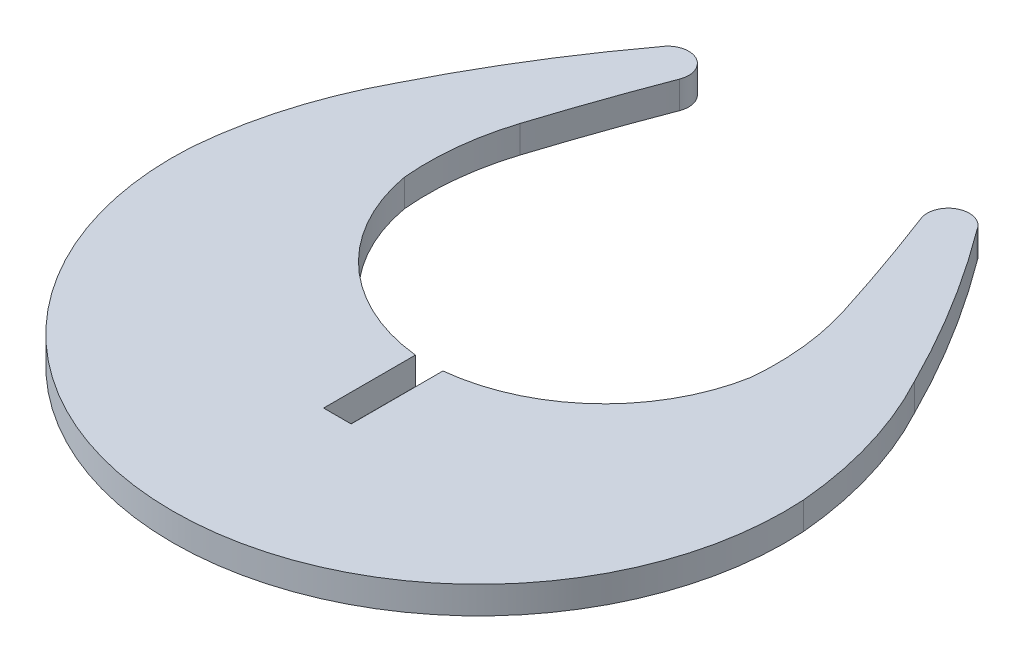
ISO-10303-21;
HEADER;
FILE_DESCRIPTION(('STEP AP214'),'2;1');
FILE_NAME('part.step','',(''),(''),'','','');
FILE_SCHEMA(('AUTOMOTIVE_DESIGN { 1 0 10303 214 1 1 1 1 }'));
ENDSEC;
DATA;
#1=APPLICATION_CONTEXT('core data for automotive mechanical design processes');
#2=APPLICATION_PROTOCOL_DEFINITION('international standard','automotive_design',2000,#1);
#3=PRODUCT_CONTEXT('',#1,'mechanical');
#4=PRODUCT('Part','Part','',(#3));
#5=PRODUCT_RELATED_PRODUCT_CATEGORY('part','',(#4));
#6=PRODUCT_DEFINITION_FORMATION('','',#4);
#7=PRODUCT_DEFINITION_CONTEXT('part definition',#1,'design');
#8=PRODUCT_DEFINITION('design','',#6,#7);
#9=PRODUCT_DEFINITION_SHAPE('','',#8);
#10=(LENGTH_UNIT() NAMED_UNIT(*) SI_UNIT(.MILLI.,.METRE.));
#11=(NAMED_UNIT(*) PLANE_ANGLE_UNIT() SI_UNIT($,.RADIAN.));
#12=(NAMED_UNIT(*) SI_UNIT($,.STERADIAN.) SOLID_ANGLE_UNIT());
#13=UNCERTAINTY_MEASURE_WITH_UNIT(LENGTH_MEASURE(1.E-05),#10,'distance_accuracy_value','');
#14=(GEOMETRIC_REPRESENTATION_CONTEXT(3) GLOBAL_UNCERTAINTY_ASSIGNED_CONTEXT((#13)) GLOBAL_UNIT_ASSIGNED_CONTEXT((#10,
#11,#12)) REPRESENTATION_CONTEXT('',''));
#15=CARTESIAN_POINT('',(0.,0.,0.));
#16=DIRECTION('',(0.,0.,1.));
#17=DIRECTION('',(1.,0.,0.));
#18=AXIS2_PLACEMENT_3D('',#15,#16,#17);
#19=CARTESIAN_POINT('',(155.975566041183,1.45,-145.975270941968));
#20=DIRECTION('',(0.,-1.,0.));
#21=DIRECTION('',(0.,0.,-1.));
#22=AXIS2_PLACEMENT_3D('',#19,#20,#21);
#23=CYLINDRICAL_SURFACE('',#22,57.904200934462);
#24=CARTESIAN_POINT('',(155.975566041183,0.,-145.975270941968));
#25=DIRECTION('',(0.,1.,0.));
#26=DIRECTION('',(0.,0.,1.));
#27=AXIS2_PLACEMENT_3D('',#24,#25,#26);
#28=CIRCLE('',#27,57.904200934462);
#29=CARTESIAN_POINT('',(207.742226256864,0.,-171.919622465427));
#30=VERTEX_POINT('',#29);
#31=CARTESIAN_POINT('',(202.450584748293,0.,-180.514656026713));
#32=VERTEX_POINT('',#31);
#33=EDGE_CURVE('E181',#30,#32,#28,.T.);
#34=ORIENTED_EDGE('',*,*,#33,.T.);
#35=DIRECTION('',(0.,-1.,0.));
#36=VECTOR('',#35,1.);
#37=CARTESIAN_POINT('',(202.450584748293,1.45,-180.514656026713));
#38=LINE('',#37,#36);
#39=CARTESIAN_POINT('',(202.450584748293,1.45,-180.514656026713));
#40=VERTEX_POINT('',#39);
#41=EDGE_CURVE('E11',#40,#32,#38,.T.);
#42=ORIENTED_EDGE('',*,*,#41,.F.);
#43=CARTESIAN_POINT('',(155.975566041183,1.45,-145.975270941968));
#44=DIRECTION('',(0.,1.,0.));
#45=DIRECTION('',(0.,0.,1.));
#46=AXIS2_PLACEMENT_3D('',#43,#44,#45);
#47=CIRCLE('',#46,57.904200934462);
#48=CARTESIAN_POINT('',(207.742226256864,1.45,-171.919622465427));
#49=VERTEX_POINT('',#48);
#50=EDGE_CURVE('E221',#49,#40,#47,.T.);
#51=ORIENTED_EDGE('',*,*,#50,.F.);
#52=DIRECTION('',(0.,-1.,0.));
#53=VECTOR('',#52,1.);
#54=CARTESIAN_POINT('',(207.742226256864,1.45,-171.919622465427));
#55=LINE('',#54,#53);
#56=EDGE_CURVE('E177',#49,#30,#55,.T.);
#57=ORIENTED_EDGE('',*,*,#56,.T.);
#58=EDGE_LOOP('',(#34,#42,#51,#57));
#59=FACE_BOUND('',#58,.T.);
#60=ADVANCED_FACE('F37',(#59),#23,.T.);
#61=CARTESIAN_POINT('',(201.492388306392,1.45,-179.948346446745));
#62=DIRECTION('',(0.,-1.,0.));
#63=DIRECTION('',(0.,0.,-1.));
#64=AXIS2_PLACEMENT_3D('',#61,#62,#63);
#65=CYLINDRICAL_SURFACE('',#64,1.11303502264534);
#66=CARTESIAN_POINT('',(201.492388306392,0.,-179.948346446745));
#67=DIRECTION('',(0.,1.,0.));
#68=DIRECTION('',(0.,0.,1.));
#69=AXIS2_PLACEMENT_3D('',#66,#67,#68);
#70=CIRCLE('',#69,1.11303502264534);
#71=CARTESIAN_POINT('',(200.454727212475,0.,-179.5457220364));
#72=VERTEX_POINT('',#71);
#73=EDGE_CURVE('E184',#32,#72,#70,.T.);
#74=ORIENTED_EDGE('',*,*,#73,.T.);
#75=DIRECTION('',(0.,-1.,0.));
#76=VECTOR('',#75,1.);
#77=CARTESIAN_POINT('',(200.454727212475,1.45,-179.5457220364));
#78=LINE('',#77,#76);
#79=CARTESIAN_POINT('',(200.454727212475,1.45,-179.5457220364));
#80=VERTEX_POINT('',#79);
#81=EDGE_CURVE('E45',#80,#72,#78,.T.);
#82=ORIENTED_EDGE('',*,*,#81,.F.);
#83=CARTESIAN_POINT('',(201.492388306392,1.45,-179.948346446745));
#84=DIRECTION('',(0.,1.,0.));
#85=DIRECTION('',(0.,0.,1.));
#86=AXIS2_PLACEMENT_3D('',#83,#84,#85);
#87=CIRCLE('',#86,1.11303502264534);
#88=EDGE_CURVE('E120',#40,#80,#87,.T.);
#89=ORIENTED_EDGE('',*,*,#88,.F.);
#90=ORIENTED_EDGE('',*,*,#41,.T.);
#91=EDGE_LOOP('',(#74,#82,#89,#90));
#92=FACE_BOUND('',#91,.T.);
#93=ADVANCED_FACE('F251',(#92),#65,.T.);
#94=CARTESIAN_POINT('',(92.1900454158658,1.45,-138.203901047659));
#95=DIRECTION('',(0.,-1.,0.));
#96=DIRECTION('',(0.,0.,-1.));
#97=AXIS2_PLACEMENT_3D('',#94,#95,#96);
#98=CYLINDRICAL_SURFACE('',#97,115.88954865382);
#99=CARTESIAN_POINT('',(92.1900454158658,0.,-138.203901047659));
#100=DIRECTION('',(0.,1.,0.));
#101=DIRECTION('',(0.,0.,1.));
#102=AXIS2_PLACEMENT_3D('',#99,#100,#101);
#103=CIRCLE('',#102,115.88954865382);
#104=CARTESIAN_POINT('',(202.640507090001,0.,-173.290693479518));
#105=VERTEX_POINT('',#104);
#106=EDGE_CURVE('E187',#105,#72,#103,.T.);
#107=ORIENTED_EDGE('',*,*,#106,.F.);
#108=DIRECTION('',(0.,-1.,0.));
#109=VECTOR('',#108,1.);
#110=CARTESIAN_POINT('',(202.640507090001,1.45,-173.290693479518));
#111=LINE('',#110,#109);
#112=CARTESIAN_POINT('',(202.640507090001,1.45,-173.290693479518));
#113=VERTEX_POINT('',#112);
#114=EDGE_CURVE('E244',#113,#105,#111,.T.);
#115=ORIENTED_EDGE('',*,*,#114,.F.);
#116=CARTESIAN_POINT('',(92.1900454158658,1.45,-138.203901047659));
#117=DIRECTION('',(0.,1.,0.));
#118=DIRECTION('',(0.,0.,1.));
#119=AXIS2_PLACEMENT_3D('',#116,#117,#118);
#120=CIRCLE('',#119,115.88954865382);
#121=EDGE_CURVE('E250',#113,#80,#120,.T.);
#122=ORIENTED_EDGE('',*,*,#121,.T.);
#123=ORIENTED_EDGE('',*,*,#81,.T.);
#124=EDGE_LOOP('',(#107,#115,#122,#123));
#125=FACE_BOUND('',#124,.T.);
#126=ADVANCED_FACE('F248',(#125),#98,.F.);
#127=CARTESIAN_POINT('',(189.25490973289,1.45,-169.038491546204));
#128=DIRECTION('',(0.,-1.,0.));
#129=DIRECTION('',(0.,0.,-1.));
#130=AXIS2_PLACEMENT_3D('',#127,#128,#129);
#131=CYLINDRICAL_SURFACE('',#130,14.044765497807);
#132=CARTESIAN_POINT('',(189.25490973289,0.,-169.038491546204));
#133=DIRECTION('',(0.,1.,0.));
#134=DIRECTION('',(0.,0.,1.));
#135=AXIS2_PLACEMENT_3D('',#132,#133,#134);
#136=CIRCLE('',#135,14.044765497807);
#137=CARTESIAN_POINT('',(203.242163560992,0.,-167.768779674707));
#138=VERTEX_POINT('',#137);
#139=EDGE_CURVE('E190',#138,#105,#136,.T.);
#140=ORIENTED_EDGE('',*,*,#139,.F.);
#141=DIRECTION('',(0.,-1.,0.));
#142=VECTOR('',#141,1.);
#143=CARTESIAN_POINT('',(203.242163560992,1.45,-167.768779674707));
#144=LINE('',#143,#142);
#145=CARTESIAN_POINT('',(203.242163560992,1.45,-167.768779674707));
#146=VERTEX_POINT('',#145);
#147=EDGE_CURVE('E242',#146,#138,#144,.T.);
#148=ORIENTED_EDGE('',*,*,#147,.F.);
#149=CARTESIAN_POINT('',(189.25490973289,1.45,-169.038491546204));
#150=DIRECTION('',(0.,1.,0.));
#151=DIRECTION('',(0.,0.,1.));
#152=AXIS2_PLACEMENT_3D('',#149,#150,#151);
#153=CIRCLE('',#152,14.044765497807);
#154=EDGE_CURVE('E262',#146,#113,#153,.T.);
#155=ORIENTED_EDGE('',*,*,#154,.T.);
#156=ORIENTED_EDGE('',*,*,#114,.T.);
#157=EDGE_LOOP('',(#140,#148,#155,#156));
#158=FACE_BOUND('',#157,.T.);
#159=ADVANCED_FACE('F259',(#158),#131,.F.);
#160=CARTESIAN_POINT('',(193.768145681941,1.45,-169.465989097798));
#161=DIRECTION('',(0.,-1.,0.));
#162=DIRECTION('',(0.,0.,-1.));
#163=AXIS2_PLACEMENT_3D('',#160,#161,#162);
#164=CYLINDRICAL_SURFACE('',#163,9.62483945831901);
#165=CARTESIAN_POINT('',(193.768145681941,0.,-169.465989097798));
#166=DIRECTION('',(0.,1.,0.));
#167=DIRECTION('',(0.,0.,1.));
#168=AXIS2_PLACEMENT_3D('',#165,#166,#167);
#169=CIRCLE('',#168,9.62483945831901);
#170=CARTESIAN_POINT('',(194.793940733524,0.,-159.89596929058));
#171=VERTEX_POINT('',#170);
#172=EDGE_CURVE('E193',#171,#138,#169,.T.);
#173=ORIENTED_EDGE('',*,*,#172,.F.);
#174=DIRECTION('',(0.,-1.,0.));
#175=VECTOR('',#174,1.);
#176=CARTESIAN_POINT('',(194.793940733524,1.45,-159.89596929058));
#177=LINE('',#176,#175);
#178=CARTESIAN_POINT('',(194.793940733524,1.45,-159.89596929058));
#179=VERTEX_POINT('',#178);
#180=EDGE_CURVE('E240',#179,#171,#177,.T.);
#181=ORIENTED_EDGE('',*,*,#180,.F.);
#182=CARTESIAN_POINT('',(193.768145681941,1.45,-169.465989097798));
#183=DIRECTION('',(0.,1.,0.));
#184=DIRECTION('',(0.,0.,1.));
#185=AXIS2_PLACEMENT_3D('',#182,#183,#184);
#186=CIRCLE('',#185,9.62483945831901);
#187=EDGE_CURVE('E266',#179,#146,#186,.T.);
#188=ORIENTED_EDGE('',*,*,#187,.T.);
#189=ORIENTED_EDGE('',*,*,#147,.T.);
#190=EDGE_LOOP('',(#173,#181,#188,#189));
#191=FACE_BOUND('',#190,.T.);
#192=ADVANCED_FACE('F323',(#191),#164,.F.);
#193=CARTESIAN_POINT('',(194.793934999714,1.45,-266.906683749552));
#194=DIRECTION('',(-0.999999999999999,0.,5.358164523349E-08));
#195=DIRECTION('',(5.358164523349E-08,0.,0.999999999999999));
#196=AXIS2_PLACEMENT_3D('',#193,#194,#195);
#197=PLANE('',#196);
#198=DIRECTION('',(-5.358164523349E-08,0.,-0.999999999999999));
#199=VECTOR('',#198,1.);
#200=CARTESIAN_POINT('',(194.793934999714,0.,-266.906683749552));
#201=LINE('',#200,#199);
#202=CARTESIAN_POINT('',(194.793940993931,0.,-155.03596389788));
#203=VERTEX_POINT('',#202);
#204=EDGE_CURVE('E196',#203,#171,#201,.T.);
#205=ORIENTED_EDGE('',*,*,#204,.F.);
#206=DIRECTION('',(0.,-1.,0.));
#207=VECTOR('',#206,1.);
#208=CARTESIAN_POINT('',(194.793940993931,1.45,-155.03596389788));
#209=LINE('',#208,#207);
#210=CARTESIAN_POINT('',(194.793940993931,1.45,-155.03596389788));
#211=VERTEX_POINT('',#210);
#212=EDGE_CURVE('E238',#211,#203,#209,.T.);
#213=ORIENTED_EDGE('',*,*,#212,.F.);
#214=DIRECTION('',(-5.358164523349E-08,0.,-0.999999999999999));
#215=VECTOR('',#214,1.);
#216=CARTESIAN_POINT('',(194.793934999714,1.45,-266.906683749552));
#217=LINE('',#216,#215);
#218=EDGE_CURVE('E272',#211,#179,#217,.T.);
#219=ORIENTED_EDGE('',*,*,#218,.T.);
#220=ORIENTED_EDGE('',*,*,#180,.T.);
#221=EDGE_LOOP('',(#205,#213,#219,#220));
#222=FACE_BOUND('',#221,.T.);
#223=ADVANCED_FACE('F326',(#222),#197,.T.);
#224=CARTESIAN_POINT('',(-48.360559474051,1.45,-155.03596389788));
#225=DIRECTION('',(0.,0.,-1.));
#226=DIRECTION('',(-1.,0.,0.));
#227=AXIS2_PLACEMENT_3D('',#224,#225,#226);
#228=PLANE('',#227);
#229=DIRECTION('',(1.,0.,0.));
#230=VECTOR('',#229,1.);
#231=CARTESIAN_POINT('',(-48.360559474051,0.,-155.03596389788));
#232=LINE('',#231,#230);
#233=CARTESIAN_POINT('',(193.33593931133,0.,-155.03596389788));
#234=VERTEX_POINT('',#233);
#235=EDGE_CURVE('E199',#234,#203,#232,.T.);
#236=ORIENTED_EDGE('',*,*,#235,.F.);
#237=DIRECTION('',(0.,-1.,0.));
#238=VECTOR('',#237,1.);
#239=CARTESIAN_POINT('',(193.33593931133,1.45,-155.03596389788));
#240=LINE('',#239,#238);
#241=CARTESIAN_POINT('',(193.33593931133,1.45,-155.03596389788));
#242=VERTEX_POINT('',#241);
#243=EDGE_CURVE('E236',#242,#234,#240,.T.);
#244=ORIENTED_EDGE('',*,*,#243,.F.);
#245=DIRECTION('',(1.,0.,0.));
#246=VECTOR('',#245,1.);
#247=CARTESIAN_POINT('',(-48.360559474051,1.45,-155.03596389788));
#248=LINE('',#247,#246);
#249=EDGE_CURVE('E275',#242,#211,#248,.T.);
#250=ORIENTED_EDGE('',*,*,#249,.T.);
#251=ORIENTED_EDGE('',*,*,#212,.T.);
#252=EDGE_LOOP('',(#236,#244,#250,#251));
#253=FACE_BOUND('',#252,.T.);
#254=ADVANCED_FACE('F330',(#253),#228,.T.);
#255=CARTESIAN_POINT('',(193.33592608195,1.45,-266.90669930298));
#256=DIRECTION('',(-0.999999999999993,0.,1.18255946199213E-07));
#257=DIRECTION('',(1.18255946199213E-07,0.,0.999999999999993));
#258=AXIS2_PLACEMENT_3D('',#255,#256,#257);
#259=PLANE('',#258);
#260=DIRECTION('',(-1.18255946199213E-07,0.,-0.999999999999993));
#261=VECTOR('',#260,1.);
#262=CARTESIAN_POINT('',(193.33592608195,0.,-266.90669930298));
#263=LINE('',#262,#261);
#264=CARTESIAN_POINT('',(193.335938736605,0.,-159.895969370789));
#265=VERTEX_POINT('',#264);
#266=EDGE_CURVE('E202',#234,#265,#263,.T.);
#267=ORIENTED_EDGE('',*,*,#266,.T.);
#268=DIRECTION('',(0.,-1.,0.));
#269=VECTOR('',#268,1.);
#270=CARTESIAN_POINT('',(193.335938736605,1.45,-159.895969370789));
#271=LINE('',#270,#269);
#272=CARTESIAN_POINT('',(193.335938736605,1.45,-159.895969370789));
#273=VERTEX_POINT('',#272);
#274=EDGE_CURVE('E234',#273,#265,#271,.T.);
#275=ORIENTED_EDGE('',*,*,#274,.F.);
#276=DIRECTION('',(-1.18255946199213E-07,0.,-0.999999999999993));
#277=VECTOR('',#276,1.);
#278=CARTESIAN_POINT('',(193.33592608195,1.45,-266.90669930298));
#279=LINE('',#278,#277);
#280=EDGE_CURVE('E278',#242,#273,#279,.T.);
#281=ORIENTED_EDGE('',*,*,#280,.F.);
#282=ORIENTED_EDGE('',*,*,#243,.T.);
#283=EDGE_LOOP('',(#267,#275,#281,#282));
#284=FACE_BOUND('',#283,.T.);
#285=ADVANCED_FACE('F334',(#284),#259,.F.);
#286=CARTESIAN_POINT('',(194.361734504164,1.45,-169.465989101263));
#287=DIRECTION('',(0.,-1.,0.));
#288=DIRECTION('',(0.,0.,-1.));
#289=AXIS2_PLACEMENT_3D('',#286,#287,#288);
#290=CYLINDRICAL_SURFACE('',#289,9.62483945831907);
#291=CARTESIAN_POINT('',(194.361734504164,0.,-169.465989101263));
#292=DIRECTION('',(0.,1.,0.));
#293=DIRECTION('',(0.,0.,1.));
#294=AXIS2_PLACEMENT_3D('',#291,#292,#293);
#295=CIRCLE('',#294,9.62483945831907);
#296=CARTESIAN_POINT('',(184.887716894081,0.,-167.76877817676));
#297=VERTEX_POINT('',#296);
#298=EDGE_CURVE('E205',#297,#265,#295,.T.);
#299=ORIENTED_EDGE('',*,*,#298,.F.);
#300=DIRECTION('',(0.,-1.,0.));
#301=VECTOR('',#300,1.);
#302=CARTESIAN_POINT('',(184.887716894081,1.45,-167.76877817676));
#303=LINE('',#302,#301);
#304=CARTESIAN_POINT('',(184.887716894081,1.45,-167.76877817676));
#305=VERTEX_POINT('',#304);
#306=EDGE_CURVE('E232',#305,#297,#303,.T.);
#307=ORIENTED_EDGE('',*,*,#306,.F.);
#308=CARTESIAN_POINT('',(194.361734504164,1.45,-169.465989101263));
#309=DIRECTION('',(0.,1.,0.));
#310=DIRECTION('',(0.,0.,1.));
#311=AXIS2_PLACEMENT_3D('',#308,#309,#310);
#312=CIRCLE('',#311,9.62483945831907);
#313=EDGE_CURVE('E280',#305,#273,#312,.T.);
#314=ORIENTED_EDGE('',*,*,#313,.T.);
#315=ORIENTED_EDGE('',*,*,#274,.T.);
#316=EDGE_LOOP('',(#299,#307,#314,#315));
#317=FACE_BOUND('',#316,.T.);
#318=ADVANCED_FACE('F338',(#317),#290,.F.);
#319=CARTESIAN_POINT('',(198.874970567289,1.45,-169.038491754589));
#320=DIRECTION('',(0.,-1.,0.));
#321=DIRECTION('',(0.,0.,-1.));
#322=AXIS2_PLACEMENT_3D('',#319,#320,#321);
#323=CYLINDRICAL_SURFACE('',#322,14.044765497807);
#324=CARTESIAN_POINT('',(198.874970567289,0.,-169.038491754589));
#325=DIRECTION('',(0.,1.,0.));
#326=DIRECTION('',(0.,0.,1.));
#327=AXIS2_PLACEMENT_3D('',#324,#325,#326);
#328=CIRCLE('',#327,14.044765497807);
#329=CARTESIAN_POINT('',(185.489370640149,0.,-173.290685597647));
#330=VERTEX_POINT('',#329);
#331=EDGE_CURVE('E208',#330,#297,#328,.T.);
#332=ORIENTED_EDGE('',*,*,#331,.F.);
#333=DIRECTION('',(0.,-1.,0.));
#334=VECTOR('',#333,1.);
#335=CARTESIAN_POINT('',(185.489370640149,1.45,-173.290685597647));
#336=LINE('',#335,#334);
#337=CARTESIAN_POINT('',(185.489370640149,1.45,-173.290685597647));
#338=VERTEX_POINT('',#337);
#339=EDGE_CURVE('E230',#338,#330,#336,.T.);
#340=ORIENTED_EDGE('',*,*,#339,.F.);
#341=CARTESIAN_POINT('',(198.874970567289,1.45,-169.038491754589));
#342=DIRECTION('',(0.,1.,0.));
#343=DIRECTION('',(0.,0.,1.));
#344=AXIS2_PLACEMENT_3D('',#341,#342,#343);
#345=CIRCLE('',#344,14.044765497807);
#346=EDGE_CURVE('E283',#338,#305,#345,.T.);
#347=ORIENTED_EDGE('',*,*,#346,.T.);
#348=ORIENTED_EDGE('',*,*,#306,.T.);
#349=EDGE_LOOP('',(#332,#340,#347,#348));
#350=FACE_BOUND('',#349,.T.);
#351=ADVANCED_FACE('F342',(#350),#323,.F.);
#352=CARTESIAN_POINT('',(295.93983444775,1.45,-138.20389988177));
#353=DIRECTION('',(0.,-1.,0.));
#354=DIRECTION('',(0.,0.,-1.));
#355=AXIS2_PLACEMENT_3D('',#352,#353,#354);
#356=CYLINDRICAL_SURFACE('',#355,115.88954865382);
#357=CARTESIAN_POINT('',(295.93983444775,0.,-138.20389988177));
#358=DIRECTION('',(0.,1.,0.));
#359=DIRECTION('',(0.,0.,1.));
#360=AXIS2_PLACEMENT_3D('',#357,#358,#359);
#361=CIRCLE('',#360,115.88954865382);
#362=CARTESIAN_POINT('',(187.675149485037,0.,-179.545712579216));
#363=VERTEX_POINT('',#362);
#364=EDGE_CURVE('E211',#363,#330,#361,.T.);
#365=ORIENTED_EDGE('',*,*,#364,.F.);
#366=DIRECTION('',(0.,-1.,0.));
#367=VECTOR('',#366,1.);
#368=CARTESIAN_POINT('',(187.675149485037,1.45,-179.545712579216));
#369=LINE('',#368,#367);
#370=CARTESIAN_POINT('',(187.675149485037,1.45,-179.545712579216));
#371=VERTEX_POINT('',#370);
#372=EDGE_CURVE('E228',#371,#363,#369,.T.);
#373=ORIENTED_EDGE('',*,*,#372,.F.);
#374=CARTESIAN_POINT('',(295.93983444775,1.45,-138.20389988177));
#375=DIRECTION('',(0.,1.,0.));
#376=DIRECTION('',(0.,0.,1.));
#377=AXIS2_PLACEMENT_3D('',#374,#375,#376);
#378=CIRCLE('',#377,115.88954865382);
#379=EDGE_CURVE('E286',#371,#338,#378,.T.);
#380=ORIENTED_EDGE('',*,*,#379,.T.);
#381=ORIENTED_EDGE('',*,*,#339,.T.);
#382=EDGE_LOOP('',(#365,#373,#380,#381));
#383=FACE_BOUND('',#382,.T.);
#384=ADVANCED_FACE('F346',(#383),#356,.F.);
#385=CARTESIAN_POINT('',(186.637491263272,1.45,-179.948344566692));
#386=DIRECTION('',(0.,-1.,0.));
#387=DIRECTION('',(0.,0.,-1.));
#388=AXIS2_PLACEMENT_3D('',#385,#386,#387);
#389=CYLINDRICAL_SURFACE('',#388,1.11303508594109);
#390=CARTESIAN_POINT('',(186.637491263272,0.,-179.948344566692));
#391=DIRECTION('',(0.,1.,0.));
#392=DIRECTION('',(0.,0.,1.));
#393=AXIS2_PLACEMENT_3D('',#390,#391,#392);
#394=CIRCLE('',#393,1.11303508594109);
#395=CARTESIAN_POINT('',(185.6792953633,0.,-180.514655188005));
#396=VERTEX_POINT('',#395);
#397=EDGE_CURVE('E214',#363,#396,#394,.T.);
#398=ORIENTED_EDGE('',*,*,#397,.T.);
#399=DIRECTION('',(0.,-1.,0.));
#400=VECTOR('',#399,1.);
#401=CARTESIAN_POINT('',(185.6792953633,1.45,-180.514655188005));
#402=LINE('',#401,#400);
#403=CARTESIAN_POINT('',(185.6792953633,1.45,-180.514655188005));
#404=VERTEX_POINT('',#403);
#405=EDGE_CURVE('E225',#404,#396,#402,.T.);
#406=ORIENTED_EDGE('',*,*,#405,.F.);
#407=CARTESIAN_POINT('',(186.637491263272,1.45,-179.948344566692));
#408=DIRECTION('',(0.,1.,0.));
#409=DIRECTION('',(0.,0.,1.));
#410=AXIS2_PLACEMENT_3D('',#407,#408,#409);
#411=CIRCLE('',#410,1.11303508594109);
#412=EDGE_CURVE('E289',#371,#404,#411,.T.);
#413=ORIENTED_EDGE('',*,*,#412,.F.);
#414=ORIENTED_EDGE('',*,*,#372,.T.);
#415=EDGE_LOOP('',(#398,#406,#413,#414));
#416=FACE_BOUND('',#415,.T.);
#417=ADVANCED_FACE('F295',(#416),#389,.T.);
#418=CARTESIAN_POINT('',(232.154313594364,1.45,-145.975269462709));
#419=DIRECTION('',(0.,-1.,0.));
#420=DIRECTION('',(0.,0.,-1.));
#421=AXIS2_PLACEMENT_3D('',#418,#419,#420);
#422=CYLINDRICAL_SURFACE('',#421,57.904200934462);
#423=CARTESIAN_POINT('',(232.154313594364,0.,-145.975269462709));
#424=DIRECTION('',(0.,1.,0.));
#425=DIRECTION('',(0.,0.,1.));
#426=AXIS2_PLACEMENT_3D('',#423,#424,#425);
#427=CIRCLE('',#426,57.904200934462);
#428=CARTESIAN_POINT('',(180.387652033985,0.,-171.919618303096));
#429=VERTEX_POINT('',#428);
#430=EDGE_CURVE('E216',#396,#429,#427,.T.);
#431=ORIENTED_EDGE('',*,*,#430,.T.);
#432=DIRECTION('',(0.,-1.,0.));
#433=VECTOR('',#432,1.);
#434=CARTESIAN_POINT('',(180.387652033985,1.45,-171.919618303096));
#435=LINE('',#434,#433);
#436=CARTESIAN_POINT('',(180.387652033985,1.45,-171.919618303096));
#437=VERTEX_POINT('',#436);
#438=EDGE_CURVE('E172',#437,#429,#435,.T.);
#439=ORIENTED_EDGE('',*,*,#438,.F.);
#440=CARTESIAN_POINT('',(232.154313594364,1.45,-145.975269462709));
#441=DIRECTION('',(0.,1.,0.));
#442=DIRECTION('',(0.,0.,1.));
#443=AXIS2_PLACEMENT_3D('',#440,#441,#442);
#444=CIRCLE('',#443,57.904200934462);
#445=EDGE_CURVE('E163',#404,#437,#444,.T.);
#446=ORIENTED_EDGE('',*,*,#445,.F.);
#447=ORIENTED_EDGE('',*,*,#405,.T.);
#448=EDGE_LOOP('',(#431,#439,#446,#447));
#449=FACE_BOUND('',#448,.T.);
#450=ADVANCED_FACE('F299',(#449),#422,.T.);
#451=CARTESIAN_POINT('',(199.431686181811,1.45,-161.653090816873));
#452=DIRECTION('',(0.,-1.,0.));
#453=DIRECTION('',(0.,0.,-1.));
#454=AXIS2_PLACEMENT_3D('',#451,#452,#453);
#455=CYLINDRICAL_SURFACE('',#454,21.635083157893);
#456=CARTESIAN_POINT('',(199.431686181811,0.,-161.653090816873));
#457=DIRECTION('',(0.,1.,0.));
#458=DIRECTION('',(0.,0.,1.));
#459=AXIS2_PLACEMENT_3D('',#456,#457,#458);
#460=CIRCLE('',#459,21.635083157893);
#461=CARTESIAN_POINT('',(177.877802643962,0.,-163.525770096888));
#462=VERTEX_POINT('',#461);
#463=EDGE_CURVE('E171',#429,#462,#460,.T.);
#464=ORIENTED_EDGE('',*,*,#463,.T.);
#465=DIRECTION('',(0.,-1.,0.));
#466=VECTOR('',#465,1.);
#467=CARTESIAN_POINT('',(177.877802643962,1.45,-163.525770096888));
#468=LINE('',#467,#466);
#469=CARTESIAN_POINT('',(177.877802643962,1.45,-163.525770096888));
#470=VERTEX_POINT('',#469);
#471=EDGE_CURVE('E168',#470,#462,#468,.T.);
#472=ORIENTED_EDGE('',*,*,#471,.F.);
#473=CARTESIAN_POINT('',(199.431686181811,1.45,-161.653090816873));
#474=DIRECTION('',(0.,1.,0.));
#475=DIRECTION('',(0.,0.,1.));
#476=AXIS2_PLACEMENT_3D('',#473,#474,#475);
#477=CIRCLE('',#476,21.635083157893);
#478=EDGE_CURVE('E157',#437,#470,#477,.T.);
#479=ORIENTED_EDGE('',*,*,#478,.F.);
#480=ORIENTED_EDGE('',*,*,#438,.T.);
#481=EDGE_LOOP('',(#464,#472,#479,#480));
#482=FACE_BOUND('',#481,.T.);
#483=ADVANCED_FACE('F169',(#482),#455,.T.);
#484=CARTESIAN_POINT('',(194.064940230044,1.45,-162.535101278485));
#485=DIRECTION('',(0.,-1.,0.));
#486=DIRECTION('',(0.,0.,-1.));
#487=AXIS2_PLACEMENT_3D('',#484,#485,#486);
#488=CYLINDRICAL_SURFACE('',#487,16.217424207885);
#489=CARTESIAN_POINT('',(194.064940230044,0.,-162.535101278485));
#490=DIRECTION('',(0.,1.,0.));
#491=DIRECTION('',(0.,0.,1.));
#492=AXIS2_PLACEMENT_3D('',#489,#490,#491);
#493=CIRCLE('',#492,16.217424207885);
#494=CARTESIAN_POINT('',(210.252077535842,0.,-163.525774676594));
#495=VERTEX_POINT('',#494);
#496=EDGE_CURVE('E106',#462,#495,#493,.T.);
#497=ORIENTED_EDGE('',*,*,#496,.T.);
#498=DIRECTION('',(0.,-1.,0.));
#499=VECTOR('',#498,1.);
#500=CARTESIAN_POINT('',(210.252077535842,1.45,-163.525774676594));
#501=LINE('',#500,#499);
#502=CARTESIAN_POINT('',(210.252077535842,1.45,-163.525774676594));
#503=VERTEX_POINT('',#502);
#504=EDGE_CURVE('E173',#503,#495,#501,.T.);
#505=ORIENTED_EDGE('',*,*,#504,.F.);
#506=CARTESIAN_POINT('',(194.064940230044,1.45,-162.535101278485));
#507=DIRECTION('',(0.,1.,0.));
#508=DIRECTION('',(0.,0.,1.));
#509=AXIS2_PLACEMENT_3D('',#506,#507,#508);
#510=CIRCLE('',#509,16.217424207885);
#511=EDGE_CURVE('E161',#470,#503,#510,.T.);
#512=ORIENTED_EDGE('',*,*,#511,.F.);
#513=ORIENTED_EDGE('',*,*,#471,.T.);
#514=EDGE_LOOP('',(#497,#505,#512,#513));
#515=FACE_BOUND('',#514,.T.);
#516=ADVANCED_FACE('F175',(#515),#488,.T.);
#517=CARTESIAN_POINT('',(188.698194166412,1.45,-161.653090650766));
#518=DIRECTION('',(0.,-1.,0.));
#519=DIRECTION('',(0.,0.,-1.));
#520=AXIS2_PLACEMENT_3D('',#517,#518,#519);
#521=CYLINDRICAL_SURFACE('',#520,21.635083400893);
#522=CARTESIAN_POINT('',(188.698194166412,0.,-161.653090650766));
#523=DIRECTION('',(0.,1.,0.));
#524=DIRECTION('',(0.,0.,1.));
#525=AXIS2_PLACEMENT_3D('',#522,#523,#524);
#526=CIRCLE('',#525,21.635083400893);
#527=EDGE_CURVE('E112',#495,#30,#526,.T.);
#528=ORIENTED_EDGE('',*,*,#527,.T.);
#529=ORIENTED_EDGE('',*,*,#56,.F.);
#530=CARTESIAN_POINT('',(188.698194166412,1.45,-161.653090650766));
#531=DIRECTION('',(0.,1.,0.));
#532=DIRECTION('',(0.,0.,1.));
#533=AXIS2_PLACEMENT_3D('',#530,#531,#532);
#534=CIRCLE('',#533,21.635083400893);
#535=EDGE_CURVE('E53',#503,#49,#534,.T.);
#536=ORIENTED_EDGE('',*,*,#535,.F.);
#537=ORIENTED_EDGE('',*,*,#504,.T.);
#538=EDGE_LOOP('',(#528,#529,#536,#537));
#539=FACE_BOUND('',#538,.T.);
#540=ADVANCED_FACE('F302',(#539),#521,.T.);
#541=CARTESIAN_POINT('',(-48.360559474051,1.45,-266.906670720934));
#542=DIRECTION('',(0.,1.,0.));
#543=DIRECTION('',(0.,0.,1.));
#544=AXIS2_PLACEMENT_3D('',#541,#542,#543);
#545=PLANE('',#544);
#546=ORIENTED_EDGE('',*,*,#50,.T.);
#547=ORIENTED_EDGE('',*,*,#88,.T.);
#548=ORIENTED_EDGE('',*,*,#121,.F.);
#549=ORIENTED_EDGE('',*,*,#154,.F.);
#550=ORIENTED_EDGE('',*,*,#187,.F.);
#551=ORIENTED_EDGE('',*,*,#218,.F.);
#552=ORIENTED_EDGE('',*,*,#249,.F.);
#553=ORIENTED_EDGE('',*,*,#280,.T.);
#554=ORIENTED_EDGE('',*,*,#313,.F.);
#555=ORIENTED_EDGE('',*,*,#346,.F.);
#556=ORIENTED_EDGE('',*,*,#379,.F.);
#557=ORIENTED_EDGE('',*,*,#412,.T.);
#558=ORIENTED_EDGE('',*,*,#445,.T.);
#559=ORIENTED_EDGE('',*,*,#478,.T.);
#560=ORIENTED_EDGE('',*,*,#511,.T.);
#561=ORIENTED_EDGE('',*,*,#535,.T.);
#562=EDGE_LOOP('',(#546,#547,#548,#549,#550,#551,#552,#553,#554,#555,#556,#557,#558,#559,#560,#561));
#563=FACE_BOUND('',#562,.T.);
#564=ADVANCED_FACE('F159',(#563),#545,.T.);
#565=CARTESIAN_POINT('',(-48.360559474051,0.,-266.906670720934));
#566=DIRECTION('',(0.,1.,0.));
#567=DIRECTION('',(0.,0.,1.));
#568=AXIS2_PLACEMENT_3D('',#565,#566,#567);
#569=PLANE('',#568);
#570=ORIENTED_EDGE('',*,*,#33,.F.);
#571=ORIENTED_EDGE('',*,*,#527,.F.);
#572=ORIENTED_EDGE('',*,*,#496,.F.);
#573=ORIENTED_EDGE('',*,*,#463,.F.);
#574=ORIENTED_EDGE('',*,*,#430,.F.);
#575=ORIENTED_EDGE('',*,*,#397,.F.);
#576=ORIENTED_EDGE('',*,*,#364,.T.);
#577=ORIENTED_EDGE('',*,*,#331,.T.);
#578=ORIENTED_EDGE('',*,*,#298,.T.);
#579=ORIENTED_EDGE('',*,*,#266,.F.);
#580=ORIENTED_EDGE('',*,*,#235,.T.);
#581=ORIENTED_EDGE('',*,*,#204,.T.);
#582=ORIENTED_EDGE('',*,*,#172,.T.);
#583=ORIENTED_EDGE('',*,*,#139,.T.);
#584=ORIENTED_EDGE('',*,*,#106,.T.);
#585=ORIENTED_EDGE('',*,*,#73,.F.);
#586=EDGE_LOOP('',(#570,#571,#572,#573,#574,#575,#576,#577,#578,#579,#580,#581,#582,#583,#584,#585));
#587=FACE_BOUND('',#586,.T.);
#588=ADVANCED_FACE('F255',(#587),#569,.F.);
#589=CLOSED_SHELL('',(#60,#93,#126,#159,#192,#223,#254,#285,#318,#351,#384,#417,#450,#483,#516,
#540,#564,#588));
#590=MANIFOLD_SOLID_BREP('B2',#589);
#591=ADVANCED_BREP_SHAPE_REPRESENTATION('',(#18,#590),#14);
#592=SHAPE_DEFINITION_REPRESENTATION(#9,#591);
ENDSEC;
END-ISO-10303-21;
